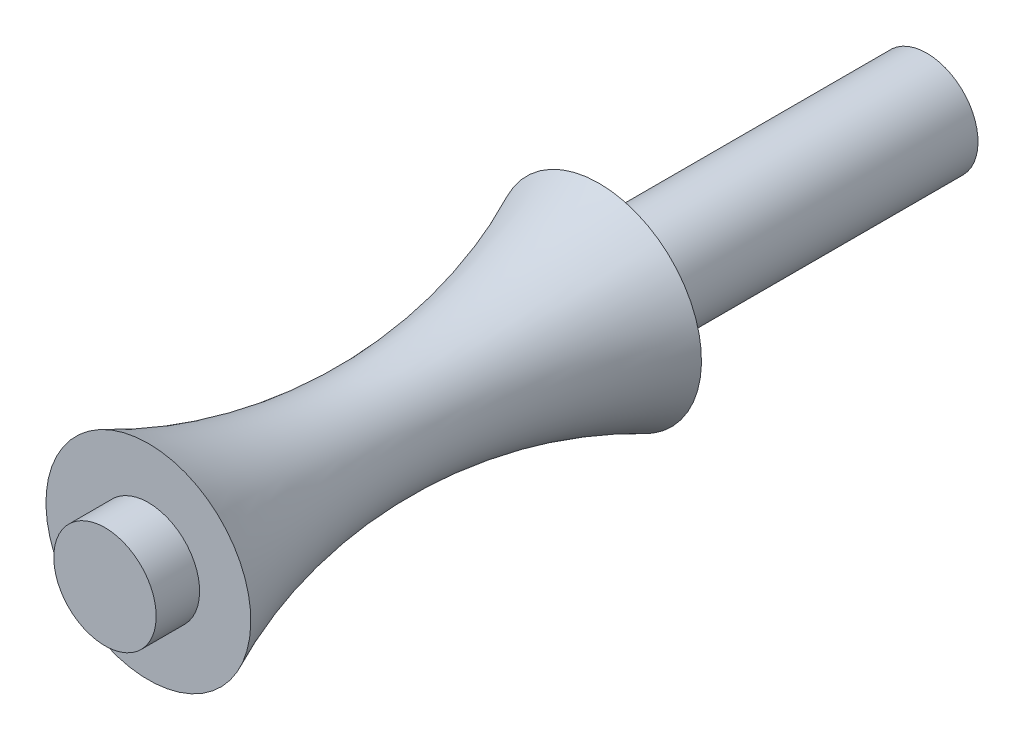
ISO-10303-21;
HEADER;
FILE_DESCRIPTION(('STEP AP214'),'2;1');
FILE_NAME('part.step','',(''),(''),'','','');
FILE_SCHEMA(('AUTOMOTIVE_DESIGN { 1 0 10303 214 1 1 1 1 }'));
ENDSEC;
DATA;
#1=APPLICATION_CONTEXT('core data for automotive mechanical design processes');
#2=APPLICATION_PROTOCOL_DEFINITION('international standard','automotive_design',2000,#1);
#3=PRODUCT_CONTEXT('',#1,'mechanical');
#4=PRODUCT('Part','Part','',(#3));
#5=PRODUCT_RELATED_PRODUCT_CATEGORY('part','',(#4));
#6=PRODUCT_DEFINITION_FORMATION('','',#4);
#7=PRODUCT_DEFINITION_CONTEXT('part definition',#1,'design');
#8=PRODUCT_DEFINITION('design','',#6,#7);
#9=PRODUCT_DEFINITION_SHAPE('','',#8);
#10=(LENGTH_UNIT() NAMED_UNIT(*) SI_UNIT(.MILLI.,.METRE.));
#11=(NAMED_UNIT(*) PLANE_ANGLE_UNIT() SI_UNIT($,.RADIAN.));
#12=(NAMED_UNIT(*) SI_UNIT($,.STERADIAN.) SOLID_ANGLE_UNIT());
#13=UNCERTAINTY_MEASURE_WITH_UNIT(LENGTH_MEASURE(1.E-05),#10,'distance_accuracy_value','');
#14=(GEOMETRIC_REPRESENTATION_CONTEXT(3) GLOBAL_UNCERTAINTY_ASSIGNED_CONTEXT((#13)) GLOBAL_UNIT_ASSIGNED_CONTEXT((#10,
#11,#12)) REPRESENTATION_CONTEXT('',''));
#15=CARTESIAN_POINT('',(0.,0.,0.));
#16=DIRECTION('',(0.,0.,1.));
#17=DIRECTION('',(1.,0.,0.));
#18=AXIS2_PLACEMENT_3D('',#15,#16,#17);
#19=CARTESIAN_POINT('',(0.,-1.74822966667726,-24.6872981981405));
#20=DIRECTION('',(0.,0.,-1.));
#21=DIRECTION('',(0.,1.,0.));
#22=AXIS2_PLACEMENT_3D('',#19,#20,#21);
#23=PLANE('',#22);
#24=CARTESIAN_POINT('',(0.,-1.74822966667726,-24.6872981981405));
#25=DIRECTION('',(0.,0.,-1.));
#26=DIRECTION('',(0.,1.,0.));
#27=AXIS2_PLACEMENT_3D('',#24,#25,#26);
#28=CIRCLE('',#27,2.5);
#29=CARTESIAN_POINT('',(0.,0.751770333322745,-24.6872981981405));
#30=VERTEX_POINT('',#29);
#31=EDGE_CURVE('E10',#30,#30,#28,.T.);
#32=ORIENTED_EDGE('',*,*,#31,.T.);
#33=EDGE_LOOP('',(#32));
#34=FACE_BOUND('',#33,.T.);
#35=ADVANCED_FACE('F32',(#34),#23,.T.);
#36=CARTESIAN_POINT('',(0.,-1.74822966667726,-24.6872981981405));
#37=DIRECTION('',(0.,0.,-1.));
#38=DIRECTION('',(0.,1.,0.));
#39=AXIS2_PLACEMENT_3D('',#36,#37,#38);
#40=CYLINDRICAL_SURFACE('',#39,2.5);
#41=CARTESIAN_POINT('',(0.,-1.74822966667726,-8.68729819814055));
#42=DIRECTION('',(0.,0.,-1.));
#43=DIRECTION('',(0.,1.,0.));
#44=AXIS2_PLACEMENT_3D('',#41,#42,#43);
#45=CIRCLE('',#44,2.5);
#46=CARTESIAN_POINT('',(0.,0.751770333322742,-8.68729819814055));
#47=VERTEX_POINT('',#46);
#48=EDGE_CURVE('E38',#47,#47,#45,.T.);
#49=ORIENTED_EDGE('',*,*,#48,.T.);
#50=EDGE_LOOP('',(#49));
#51=FACE_BOUND('',#50,.T.);
#52=ORIENTED_EDGE('',*,*,#31,.F.);
#53=EDGE_LOOP('',(#52));
#54=FACE_BOUND('',#53,.T.);
#55=ADVANCED_FACE('F70',(#51,#54),#40,.T.);
#56=CARTESIAN_POINT('',(0.,0.751770333322743,-8.68729819814055));
#57=DIRECTION('',(0.,0.,-1.));
#58=DIRECTION('',(0.,1.,0.));
#59=AXIS2_PLACEMENT_3D('',#56,#57,#58);
#60=PLANE('',#59);
#61=CARTESIAN_POINT('',(0.,-1.74822966667726,-8.68729819814055));
#62=DIRECTION('',(0.,0.,-1.));
#63=DIRECTION('',(0.,1.,0.));
#64=AXIS2_PLACEMENT_3D('',#61,#62,#63);
#65=CIRCLE('',#64,5.);
#66=CARTESIAN_POINT('',(0.,3.25177033332275,-8.68729819814055));
#67=VERTEX_POINT('',#66);
#68=EDGE_CURVE('E42',#67,#67,#65,.T.);
#69=ORIENTED_EDGE('',*,*,#68,.T.);
#70=EDGE_LOOP('',(#69));
#71=FACE_BOUND('',#70,.T.);
#72=ORIENTED_EDGE('',*,*,#48,.F.);
#73=EDGE_LOOP('',(#72));
#74=FACE_BOUND('',#73,.T.);
#75=ADVANCED_FACE('F74',(#71,#74),#60,.T.);
#76=CARTESIAN_POINT('',(0.,-1.74822966667726,2.31270180185945));
#77=DIRECTION('',(0.,0.,-1.));
#78=DIRECTION('',(0.,1.,0.));
#79=AXIS2_PLACEMENT_3D('',#76,#77,#78);
#80=TOROIDAL_SURFACE('',#79,28.6014336809761,26.038964491652);
#81=CARTESIAN_POINT('',(0.,-1.74822966667726,13.3127018018595));
#82=DIRECTION('',(0.,0.,-1.));
#83=DIRECTION('',(0.,1.,0.));
#84=AXIS2_PLACEMENT_3D('',#81,#82,#83);
#85=CIRCLE('',#84,5.);
#86=CARTESIAN_POINT('',(0.,3.25177033332274,13.3127018018595));
#87=VERTEX_POINT('',#86);
#88=EDGE_CURVE('E46',#87,#87,#85,.T.);
#89=ORIENTED_EDGE('',*,*,#88,.T.);
#90=EDGE_LOOP('',(#89));
#91=FACE_BOUND('',#90,.T.);
#92=ORIENTED_EDGE('',*,*,#68,.F.);
#93=EDGE_LOOP('',(#92));
#94=FACE_BOUND('',#93,.T.);
#95=ADVANCED_FACE('F78',(#91,#94),#80,.F.);
#96=CARTESIAN_POINT('',(0.,0.751770333322743,13.3127018018595));
#97=DIRECTION('',(0.,0.,1.));
#98=DIRECTION('',(0.,-1.,0.));
#99=AXIS2_PLACEMENT_3D('',#96,#97,#98);
#100=PLANE('',#99);
#101=CARTESIAN_POINT('',(0.,-1.74822966667726,13.3127018018595));
#102=DIRECTION('',(0.,0.,-1.));
#103=DIRECTION('',(0.,1.,0.));
#104=AXIS2_PLACEMENT_3D('',#101,#102,#103);
#105=CIRCLE('',#104,2.5);
#106=CARTESIAN_POINT('',(0.,0.751770333322742,13.3127018018595));
#107=VERTEX_POINT('',#106);
#108=EDGE_CURVE('E51',#107,#107,#105,.T.);
#109=ORIENTED_EDGE('',*,*,#108,.T.);
#110=EDGE_LOOP('',(#109));
#111=FACE_BOUND('',#110,.T.);
#112=ORIENTED_EDGE('',*,*,#88,.F.);
#113=EDGE_LOOP('',(#112));
#114=FACE_BOUND('',#113,.T.);
#115=ADVANCED_FACE('F67',(#111,#114),#100,.T.);
#116=CARTESIAN_POINT('',(0.,-1.74822966667726,-24.6872981981405));
#117=DIRECTION('',(0.,0.,-1.));
#118=DIRECTION('',(0.,1.,0.));
#119=AXIS2_PLACEMENT_3D('',#116,#117,#118);
#120=CYLINDRICAL_SURFACE('',#119,2.5);
#121=CARTESIAN_POINT('',(0.,-1.74822966667726,15.4311716186086));
#122=DIRECTION('',(0.,0.,-1.));
#123=DIRECTION('',(0.,1.,0.));
#124=AXIS2_PLACEMENT_3D('',#121,#122,#123);
#125=CIRCLE('',#124,2.5);
#126=CARTESIAN_POINT('',(0.,0.75177033332274,15.4311716186086));
#127=VERTEX_POINT('',#126);
#128=EDGE_CURVE('E54',#127,#127,#125,.T.);
#129=ORIENTED_EDGE('',*,*,#128,.T.);
#130=EDGE_LOOP('',(#129));
#131=FACE_BOUND('',#130,.T.);
#132=ORIENTED_EDGE('',*,*,#108,.F.);
#133=EDGE_LOOP('',(#132));
#134=FACE_BOUND('',#133,.T.);
#135=ADVANCED_FACE('F58',(#131,#134),#120,.T.);
#136=CARTESIAN_POINT('',(0.,-1.74822966667726,15.4311716186086));
#137=DIRECTION('',(0.,0.,1.));
#138=DIRECTION('',(0.,-1.,0.));
#139=AXIS2_PLACEMENT_3D('',#136,#137,#138);
#140=PLANE('',#139);
#141=ORIENTED_EDGE('',*,*,#128,.F.);
#142=EDGE_LOOP('',(#141));
#143=FACE_BOUND('',#142,.T.);
#144=ADVANCED_FACE('F61',(#143),#140,.T.);
#145=CLOSED_SHELL('',(#35,#55,#75,#95,#115,#135,#144));
#146=MANIFOLD_SOLID_BREP('B2',#145);
#147=ADVANCED_BREP_SHAPE_REPRESENTATION('',(#18,#146),#14);
#148=SHAPE_DEFINITION_REPRESENTATION(#9,#147);
ENDSEC;
END-ISO-10303-21;
